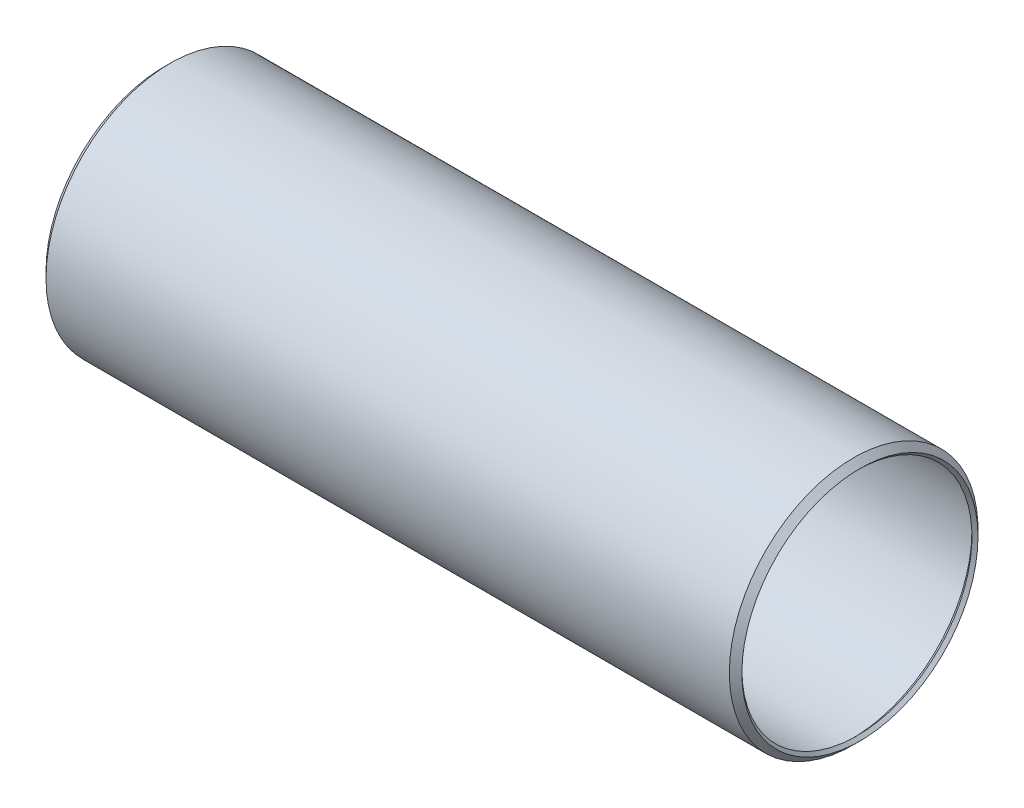
ISO-10303-21;
HEADER;
FILE_DESCRIPTION(('STEP AP214'),'2;1');
FILE_NAME('part.step','',(''),(''),'','','');
FILE_SCHEMA(('AUTOMOTIVE_DESIGN { 1 0 10303 214 1 1 1 1 }'));
ENDSEC;
DATA;
#1=APPLICATION_CONTEXT('core data for automotive mechanical design processes');
#2=APPLICATION_PROTOCOL_DEFINITION('international standard','automotive_design',2000,#1);
#3=PRODUCT_CONTEXT('',#1,'mechanical');
#4=PRODUCT('Part','Part','',(#3));
#5=PRODUCT_RELATED_PRODUCT_CATEGORY('part','',(#4));
#6=PRODUCT_DEFINITION_FORMATION('','',#4);
#7=PRODUCT_DEFINITION_CONTEXT('part definition',#1,'design');
#8=PRODUCT_DEFINITION('design','',#6,#7);
#9=PRODUCT_DEFINITION_SHAPE('','',#8);
#10=(LENGTH_UNIT() NAMED_UNIT(*) SI_UNIT(.MILLI.,.METRE.));
#11=(NAMED_UNIT(*) PLANE_ANGLE_UNIT() SI_UNIT($,.RADIAN.));
#12=(NAMED_UNIT(*) SI_UNIT($,.STERADIAN.) SOLID_ANGLE_UNIT());
#13=UNCERTAINTY_MEASURE_WITH_UNIT(LENGTH_MEASURE(1.E-05),#10,'distance_accuracy_value','');
#14=(GEOMETRIC_REPRESENTATION_CONTEXT(3) GLOBAL_UNCERTAINTY_ASSIGNED_CONTEXT((#13)) GLOBAL_UNIT_ASSIGNED_CONTEXT((#10,
#11,#12)) REPRESENTATION_CONTEXT('',''));
#15=CARTESIAN_POINT('',(0.,0.,0.));
#16=DIRECTION('',(0.,0.,1.));
#17=DIRECTION('',(1.,0.,0.));
#18=AXIS2_PLACEMENT_3D('',#15,#16,#17);
#19=CARTESIAN_POINT('',(-137.843556881434,0.,0.));
#20=DIRECTION('',(1.,0.,0.));
#21=DIRECTION('',(0.,0.,-1.));
#22=AXIS2_PLACEMENT_3D('',#19,#20,#21);
#23=CONICAL_SURFACE('',#22,26.4922000000035,0.785398163397451);
#24=CARTESIAN_POINT('',(-139.17817844072,0.,0.));
#25=DIRECTION('',(-1.,0.,0.));
#26=DIRECTION('',(0.,0.,1.));
#27=AXIS2_PLACEMENT_3D('',#24,#25,#26);
#28=CIRCLE('',#27,25.157578440717);
#29=CARTESIAN_POINT('',(-139.17817844072,0.,25.157578440717));
#30=VERTEX_POINT('',#29);
#31=EDGE_CURVE('E10',#30,#30,#28,.T.);
#32=ORIENTED_EDGE('',*,*,#31,.F.);
#33=EDGE_LOOP('',(#32));
#34=FACE_BOUND('',#33,.T.);
#35=CARTESIAN_POINT('',(-137.843556881434,0.,0.));
#36=DIRECTION('',(-1.,0.,0.));
#37=DIRECTION('',(0.,0.,1.));
#38=AXIS2_PLACEMENT_3D('',#35,#36,#37);
#39=CIRCLE('',#38,26.4922000000035);
#40=CARTESIAN_POINT('',(-137.843556881434,0.,26.4922000000035));
#41=VERTEX_POINT('',#40);
#42=EDGE_CURVE('E59',#41,#41,#39,.T.);
#43=ORIENTED_EDGE('',*,*,#42,.T.);
#44=EDGE_LOOP('',(#43));
#45=FACE_BOUND('',#44,.T.);
#46=ADVANCED_FACE('F31',(#34,#45),#23,.T.);
#47=CARTESIAN_POINT('',(-139.17817844072,0.,0.));
#48=DIRECTION('',(-1.,0.,0.));
#49=DIRECTION('',(0.,0.,1.));
#50=AXIS2_PLACEMENT_3D('',#47,#48,#49);
#51=CONICAL_SURFACE('',#50,25.157578440717,0.785398163397451);
#52=CARTESIAN_POINT('',(-138.531600000002,0.,0.));
#53=DIRECTION('',(-1.,0.,0.));
#54=DIRECTION('',(0.,0.,1.));
#55=AXIS2_PLACEMENT_3D('',#52,#53,#54);
#56=CIRCLE('',#55,24.5109999999985);
#57=CARTESIAN_POINT('',(-138.531600000002,0.,24.5109999999985));
#58=VERTEX_POINT('',#57);
#59=EDGE_CURVE('E37',#58,#58,#56,.T.);
#60=ORIENTED_EDGE('',*,*,#59,.F.);
#61=EDGE_LOOP('',(#60));
#62=FACE_BOUND('',#61,.T.);
#63=ORIENTED_EDGE('',*,*,#31,.T.);
#64=EDGE_LOOP('',(#63));
#65=FACE_BOUND('',#64,.T.);
#66=ADVANCED_FACE('F96',(#62,#65),#51,.F.);
#67=CARTESIAN_POINT('',(-138.531600000002,0.,0.));
#68=DIRECTION('',(1.,0.,0.));
#69=DIRECTION('',(0.,0.,-1.));
#70=AXIS2_PLACEMENT_3D('',#67,#68,#69);
#71=CONICAL_SURFACE('',#70,24.5109999999985,0.785398163397448);
#72=CARTESIAN_POINT('',(-137.464800000002,0.,0.));
#73=DIRECTION('',(-1.,0.,0.));
#74=DIRECTION('',(0.,0.,1.));
#75=AXIS2_PLACEMENT_3D('',#72,#73,#74);
#76=CIRCLE('',#75,25.5777999999985);
#77=CARTESIAN_POINT('',(-137.464800000002,0.,25.5777999999985));
#78=VERTEX_POINT('',#77);
#79=EDGE_CURVE('E41',#78,#78,#76,.T.);
#80=ORIENTED_EDGE('',*,*,#79,.F.);
#81=EDGE_LOOP('',(#80));
#82=FACE_BOUND('',#81,.T.);
#83=ORIENTED_EDGE('',*,*,#59,.T.);
#84=EDGE_LOOP('',(#83));
#85=FACE_BOUND('',#84,.T.);
#86=ADVANCED_FACE('F91',(#82,#85),#71,.F.);
#87=CARTESIAN_POINT('',(7.3914,0.,0.));
#88=DIRECTION('',(-1.,0.,0.));
#89=DIRECTION('',(0.,0.,1.));
#90=AXIS2_PLACEMENT_3D('',#87,#88,#89);
#91=CYLINDRICAL_SURFACE('',#90,25.5777999999985);
#92=CARTESIAN_POINT('',(7.3913999999985,0.,0.));
#93=DIRECTION('',(-1.,0.,0.));
#94=DIRECTION('',(0.,0.,1.));
#95=AXIS2_PLACEMENT_3D('',#92,#93,#94);
#96=CIRCLE('',#95,25.5777999999985);
#97=CARTESIAN_POINT('',(7.3913999999985,0.,25.5777999999985));
#98=VERTEX_POINT('',#97);
#99=EDGE_CURVE('E45',#98,#98,#96,.T.);
#100=ORIENTED_EDGE('',*,*,#99,.F.);
#101=EDGE_LOOP('',(#100));
#102=FACE_BOUND('',#101,.T.);
#103=ORIENTED_EDGE('',*,*,#79,.T.);
#104=EDGE_LOOP('',(#103));
#105=FACE_BOUND('',#104,.T.);
#106=ADVANCED_FACE('F85',(#102,#105),#91,.F.);
#107=CARTESIAN_POINT('',(7.3913999999985,0.,0.));
#108=DIRECTION('',(-1.,0.,0.));
#109=DIRECTION('',(0.,0.,1.));
#110=AXIS2_PLACEMENT_3D('',#107,#108,#109);
#111=CONICAL_SURFACE('',#110,25.5777999999985,0.785398163397448);
#112=CARTESIAN_POINT('',(8.4581999999985,0.,0.));
#113=DIRECTION('',(-1.,0.,0.));
#114=DIRECTION('',(0.,0.,1.));
#115=AXIS2_PLACEMENT_3D('',#112,#113,#114);
#116=CIRCLE('',#115,24.5109999999985);
#117=CARTESIAN_POINT('',(8.4581999999985,0.,24.5109999999985));
#118=VERTEX_POINT('',#117);
#119=EDGE_CURVE('E50',#118,#118,#116,.T.);
#120=ORIENTED_EDGE('',*,*,#119,.F.);
#121=EDGE_LOOP('',(#120));
#122=FACE_BOUND('',#121,.T.);
#123=ORIENTED_EDGE('',*,*,#99,.T.);
#124=EDGE_LOOP('',(#123));
#125=FACE_BOUND('',#124,.T.);
#126=ADVANCED_FACE('F79',(#122,#125),#111,.F.);
#127=CARTESIAN_POINT('',(8.4581999999985,0.,0.));
#128=DIRECTION('',(1.,0.,0.));
#129=DIRECTION('',(0.,0.,-1.));
#130=AXIS2_PLACEMENT_3D('',#127,#128,#129);
#131=CONICAL_SURFACE('',#130,24.5109999999985,0.785398163397446);
#132=CARTESIAN_POINT('',(9.104778440717,0.,0.));
#133=DIRECTION('',(-1.,0.,0.));
#134=DIRECTION('',(0.,0.,1.));
#135=AXIS2_PLACEMENT_3D('',#132,#133,#134);
#136=CIRCLE('',#135,25.157578440717);
#137=CARTESIAN_POINT('',(9.104778440717,0.,25.157578440717));
#138=VERTEX_POINT('',#137);
#139=EDGE_CURVE('E53',#138,#138,#136,.T.);
#140=ORIENTED_EDGE('',*,*,#139,.F.);
#141=EDGE_LOOP('',(#140));
#142=FACE_BOUND('',#141,.T.);
#143=ORIENTED_EDGE('',*,*,#119,.T.);
#144=EDGE_LOOP('',(#143));
#145=FACE_BOUND('',#144,.T.);
#146=ADVANCED_FACE('F73',(#142,#145),#131,.F.);
#147=CARTESIAN_POINT('',(9.104778440717,0.,0.));
#148=DIRECTION('',(-1.,0.,0.));
#149=DIRECTION('',(0.,0.,1.));
#150=AXIS2_PLACEMENT_3D('',#147,#148,#149);
#151=CONICAL_SURFACE('',#150,25.157578440717,0.785398163397411);
#152=CARTESIAN_POINT('',(7.77015688143041,0.,0.));
#153=DIRECTION('',(-1.,0.,0.));
#154=DIRECTION('',(0.,0.,1.));
#155=AXIS2_PLACEMENT_3D('',#152,#153,#154);
#156=CIRCLE('',#155,26.4922000000035);
#157=CARTESIAN_POINT('',(7.77015688143041,0.,26.4922000000035));
#158=VERTEX_POINT('',#157);
#159=EDGE_CURVE('E56',#158,#158,#156,.T.);
#160=ORIENTED_EDGE('',*,*,#159,.F.);
#161=EDGE_LOOP('',(#160));
#162=FACE_BOUND('',#161,.T.);
#163=ORIENTED_EDGE('',*,*,#139,.T.);
#164=EDGE_LOOP('',(#163));
#165=FACE_BOUND('',#164,.T.);
#166=ADVANCED_FACE('F67',(#162,#165),#151,.T.);
#167=CARTESIAN_POINT('',(7.3914,0.,0.));
#168=DIRECTION('',(-1.,0.,0.));
#169=DIRECTION('',(0.,0.,1.));
#170=AXIS2_PLACEMENT_3D('',#167,#168,#169);
#171=CYLINDRICAL_SURFACE('',#170,26.4922000000035);
#172=ORIENTED_EDGE('',*,*,#42,.F.);
#173=EDGE_LOOP('',(#172));
#174=FACE_BOUND('',#173,.T.);
#175=ORIENTED_EDGE('',*,*,#159,.T.);
#176=EDGE_LOOP('',(#175));
#177=FACE_BOUND('',#176,.T.);
#178=ADVANCED_FACE('F64',(#174,#177),#171,.T.);
#179=CLOSED_SHELL('',(#46,#66,#86,#106,#126,#146,#166,#178));
#180=MANIFOLD_SOLID_BREP('B2',#179);
#181=ADVANCED_BREP_SHAPE_REPRESENTATION('',(#18,#180),#14);
#182=SHAPE_DEFINITION_REPRESENTATION(#9,#181);
ENDSEC;
END-ISO-10303-21;
